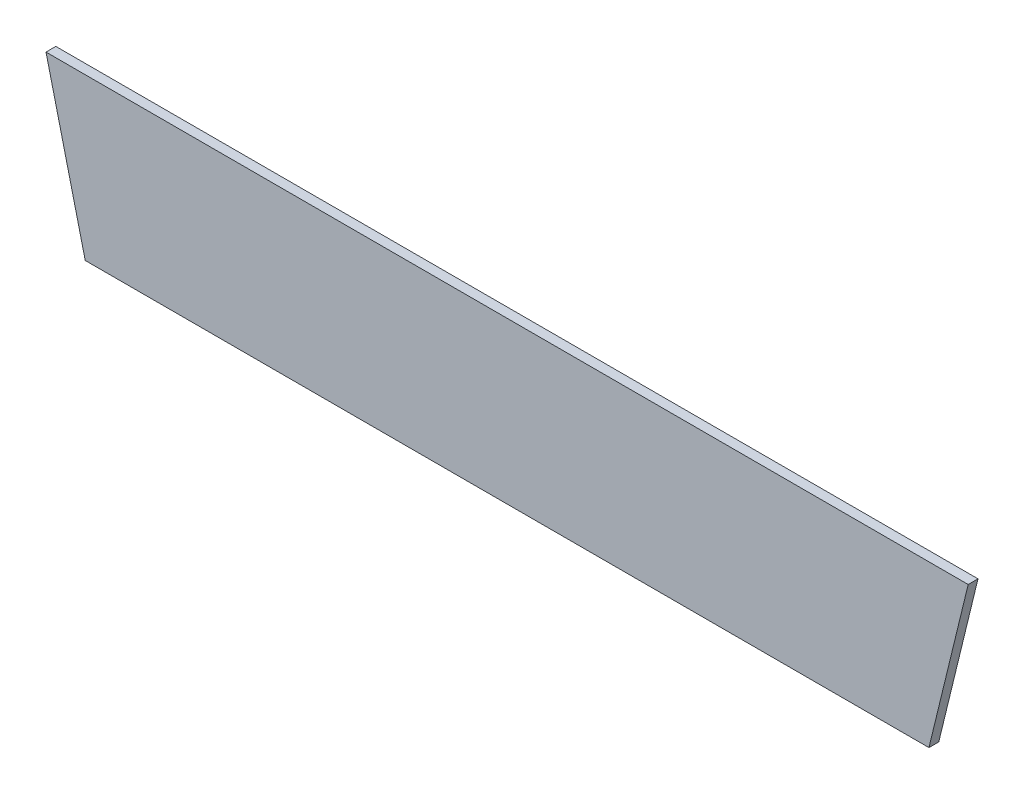
ISO-10303-21;
HEADER;
FILE_DESCRIPTION(('STEP AP214'),'2;1');
FILE_NAME('part.step','',(''),(''),'','','');
FILE_SCHEMA(('AUTOMOTIVE_DESIGN { 1 0 10303 214 1 1 1 1 }'));
ENDSEC;
DATA;
#1=APPLICATION_CONTEXT('core data for automotive mechanical design processes');
#2=APPLICATION_PROTOCOL_DEFINITION('international standard','automotive_design',2000,#1);
#3=PRODUCT_CONTEXT('',#1,'mechanical');
#4=PRODUCT('Part','Part','',(#3));
#5=PRODUCT_RELATED_PRODUCT_CATEGORY('part','',(#4));
#6=PRODUCT_DEFINITION_FORMATION('','',#4);
#7=PRODUCT_DEFINITION_CONTEXT('part definition',#1,'design');
#8=PRODUCT_DEFINITION('design','',#6,#7);
#9=PRODUCT_DEFINITION_SHAPE('','',#8);
#10=(LENGTH_UNIT() NAMED_UNIT(*) SI_UNIT(.MILLI.,.METRE.));
#11=(NAMED_UNIT(*) PLANE_ANGLE_UNIT() SI_UNIT($,.RADIAN.));
#12=(NAMED_UNIT(*) SI_UNIT($,.STERADIAN.) SOLID_ANGLE_UNIT());
#13=UNCERTAINTY_MEASURE_WITH_UNIT(LENGTH_MEASURE(1.E-05),#10,'distance_accuracy_value','');
#14=(GEOMETRIC_REPRESENTATION_CONTEXT(3) GLOBAL_UNCERTAINTY_ASSIGNED_CONTEXT((#13)) GLOBAL_UNIT_ASSIGNED_CONTEXT((#10,
#11,#12)) REPRESENTATION_CONTEXT('',''));
#15=CARTESIAN_POINT('',(0.,0.,0.));
#16=DIRECTION('',(0.,0.,1.));
#17=DIRECTION('',(1.,0.,0.));
#18=AXIS2_PLACEMENT_3D('',#15,#16,#17);
#19=CARTESIAN_POINT('',(2.35000038,0.41000172,0.0499999));
#20=DIRECTION('',(0.,0.,1.));
#21=DIRECTION('',(1.,0.,0.));
#22=AXIS2_PLACEMENT_3D('',#19,#20,#21);
#23=PLANE('',#22);
#24=DIRECTION('',(-1.,0.,0.));
#25=VECTOR('',#24,1.);
#26=CARTESIAN_POINT('',(2.15000078,-0.40999918,0.0499999));
#27=LINE('',#26,#25);
#28=CARTESIAN_POINT('',(2.15000078000008,-0.409999180000019,0.0499999));
#29=VERTEX_POINT('',#28);
#30=CARTESIAN_POINT('',(-2.15000078,-0.40999918,0.0499999));
#31=VERTEX_POINT('',#30);
#32=EDGE_CURVE('E63',#29,#31,#27,.T.);
#33=ORIENTED_EDGE('',*,*,#32,.F.);
#34=DIRECTION('',(0.236955487417398,0.971520507752041,0.));
#35=VECTOR('',#34,1.);
#36=CARTESIAN_POINT('',(2.15000078,-0.40999918,0.0499999));
#37=LINE('',#36,#35);
#38=CARTESIAN_POINT('',(2.35000038,0.41000172,0.0499999));
#39=VERTEX_POINT('',#38);
#40=EDGE_CURVE('E61',#29,#39,#37,.T.);
#41=ORIENTED_EDGE('',*,*,#40,.T.);
#42=DIRECTION('',(1.,0.,0.));
#43=VECTOR('',#42,1.);
#44=CARTESIAN_POINT('',(-2.35000038,0.41000172,0.0499999));
#45=LINE('',#44,#43);
#46=CARTESIAN_POINT('',(-2.35000037999992,0.410001720000019,0.0499999));
#47=VERTEX_POINT('',#46);
#48=EDGE_CURVE('E11',#47,#39,#45,.T.);
#49=ORIENTED_EDGE('',*,*,#48,.F.);
#50=DIRECTION('',(-0.236955487417032,0.97152050775213,0.));
#51=VECTOR('',#50,1.);
#52=CARTESIAN_POINT('',(-2.15000078,-0.40999918,0.0499999));
#53=LINE('',#52,#51);
#54=EDGE_CURVE('E26',#31,#47,#53,.T.);
#55=ORIENTED_EDGE('',*,*,#54,.F.);
#56=EDGE_LOOP('',(#33,#41,#49,#55));
#57=FACE_BOUND('',#56,.T.);
#58=ADVANCED_FACE('F17',(#57),#23,.T.);
#59=CARTESIAN_POINT('',(-2.35000038,0.41000172,0.));
#60=DIRECTION('',(0.,1.,0.));
#61=DIRECTION('',(1.,0.,0.));
#62=AXIS2_PLACEMENT_3D('',#59,#60,#61);
#63=PLANE('',#62);
#64=DIRECTION('',(0.,0.,1.));
#65=VECTOR('',#64,1.);
#66=CARTESIAN_POINT('',(2.35000038,0.41000172,0.));
#67=LINE('',#66,#65);
#68=CARTESIAN_POINT('',(2.35000038,0.41000172,0.));
#69=VERTEX_POINT('',#68);
#70=EDGE_CURVE('E56',#69,#39,#67,.T.);
#71=ORIENTED_EDGE('',*,*,#70,.F.);
#72=DIRECTION('',(-1.,0.,0.));
#73=VECTOR('',#72,1.);
#74=CARTESIAN_POINT('',(2.35000038,0.41000172,0.));
#75=LINE('',#74,#73);
#76=CARTESIAN_POINT('',(-2.35000037999992,0.410001720000019,0.));
#77=VERTEX_POINT('',#76);
#78=EDGE_CURVE('E111',#69,#77,#75,.T.);
#79=ORIENTED_EDGE('',*,*,#78,.T.);
#80=DIRECTION('',(0.,0.,-1.));
#81=VECTOR('',#80,1.);
#82=CARTESIAN_POINT('',(-2.35000037999969,0.410001720000075,0.));
#83=LINE('',#82,#81);
#84=EDGE_CURVE('E59',#47,#77,#83,.T.);
#85=ORIENTED_EDGE('',*,*,#84,.F.);
#86=ORIENTED_EDGE('',*,*,#48,.T.);
#87=EDGE_LOOP('',(#71,#79,#85,#86));
#88=FACE_BOUND('',#87,.T.);
#89=ADVANCED_FACE('F53',(#88),#63,.T.);
#90=CARTESIAN_POINT('',(-2.15000078,-0.40999918,0.));
#91=DIRECTION('',(-0.97152050775213,-0.236955487417032,0.));
#92=DIRECTION('',(-0.236955487417032,0.97152050775213,0.));
#93=AXIS2_PLACEMENT_3D('',#90,#91,#92);
#94=PLANE('',#93);
#95=ORIENTED_EDGE('',*,*,#84,.T.);
#96=DIRECTION('',(0.236955487417398,-0.971520507752041,0.));
#97=VECTOR('',#96,1.);
#98=CARTESIAN_POINT('',(-2.35000038,0.41000172,0.));
#99=LINE('',#98,#97);
#100=CARTESIAN_POINT('',(-2.15000078,-0.40999918,0.));
#101=VERTEX_POINT('',#100);
#102=EDGE_CURVE('E108',#77,#101,#99,.T.);
#103=ORIENTED_EDGE('',*,*,#102,.T.);
#104=DIRECTION('',(0.,0.,-1.));
#105=VECTOR('',#104,1.);
#106=CARTESIAN_POINT('',(-2.15000078,-0.40999918,0.));
#107=LINE('',#106,#105);
#108=EDGE_CURVE('E68',#31,#101,#107,.T.);
#109=ORIENTED_EDGE('',*,*,#108,.F.);
#110=ORIENTED_EDGE('',*,*,#54,.T.);
#111=EDGE_LOOP('',(#95,#103,#109,#110));
#112=FACE_BOUND('',#111,.T.);
#113=ADVANCED_FACE('F93',(#112),#94,.T.);
#114=CARTESIAN_POINT('',(2.15000078,-0.40999918,0.));
#115=DIRECTION('',(0.,-1.,0.));
#116=DIRECTION('',(0.,0.,-1.));
#117=AXIS2_PLACEMENT_3D('',#114,#115,#116);
#118=PLANE('',#117);
#119=ORIENTED_EDGE('',*,*,#108,.T.);
#120=DIRECTION('',(1.,0.,0.));
#121=VECTOR('',#120,1.);
#122=CARTESIAN_POINT('',(2.35000038,-0.40999918,0.));
#123=LINE('',#122,#121);
#124=CARTESIAN_POINT('',(2.15000078000008,-0.409999180000019,0.));
#125=VERTEX_POINT('',#124);
#126=EDGE_CURVE('E105',#101,#125,#123,.T.);
#127=ORIENTED_EDGE('',*,*,#126,.T.);
#128=DIRECTION('',(0.,0.,-1.));
#129=VECTOR('',#128,1.);
#130=CARTESIAN_POINT('',(2.15000078000031,-0.409999180000075,0.));
#131=LINE('',#130,#129);
#132=EDGE_CURVE('E75',#29,#125,#131,.T.);
#133=ORIENTED_EDGE('',*,*,#132,.F.);
#134=ORIENTED_EDGE('',*,*,#32,.T.);
#135=EDGE_LOOP('',(#119,#127,#133,#134));
#136=FACE_BOUND('',#135,.T.);
#137=ADVANCED_FACE('F97',(#136),#118,.T.);
#138=CARTESIAN_POINT('',(2.35000038,0.41000172,0.));
#139=DIRECTION('',(0.97152050775213,-0.236955487417032,0.));
#140=DIRECTION('',(0.,0.,-1.));
#141=AXIS2_PLACEMENT_3D('',#138,#139,#140);
#142=PLANE('',#141);
#143=ORIENTED_EDGE('',*,*,#132,.T.);
#144=DIRECTION('',(0.236955487417398,0.971520507752041,0.));
#145=VECTOR('',#144,1.);
#146=CARTESIAN_POINT('',(2.15000078,-0.40999918,0.));
#147=LINE('',#146,#145);
#148=EDGE_CURVE('E72',#125,#69,#147,.T.);
#149=ORIENTED_EDGE('',*,*,#148,.T.);
#150=ORIENTED_EDGE('',*,*,#70,.T.);
#151=ORIENTED_EDGE('',*,*,#40,.F.);
#152=EDGE_LOOP('',(#143,#149,#150,#151));
#153=FACE_BOUND('',#152,.T.);
#154=ADVANCED_FACE('F70',(#153),#142,.T.);
#155=CARTESIAN_POINT('',(2.35000038,0.41000172,0.));
#156=DIRECTION('',(0.,0.,1.));
#157=DIRECTION('',(1.,0.,0.));
#158=AXIS2_PLACEMENT_3D('',#155,#156,#157);
#159=PLANE('',#158);
#160=ORIENTED_EDGE('',*,*,#126,.F.);
#161=ORIENTED_EDGE('',*,*,#102,.F.);
#162=ORIENTED_EDGE('',*,*,#78,.F.);
#163=ORIENTED_EDGE('',*,*,#148,.F.);
#164=EDGE_LOOP('',(#160,#161,#162,#163));
#165=FACE_BOUND('',#164,.T.);
#166=ADVANCED_FACE('F184',(#165),#159,.F.);
#167=CLOSED_SHELL('',(#58,#89,#113,#137,#154,#166));
#168=MANIFOLD_SOLID_BREP('B1',#167);
#169=ADVANCED_BREP_SHAPE_REPRESENTATION('',(#18,#168),#14);
#170=SHAPE_DEFINITION_REPRESENTATION(#9,#169);
ENDSEC;
END-ISO-10303-21;
